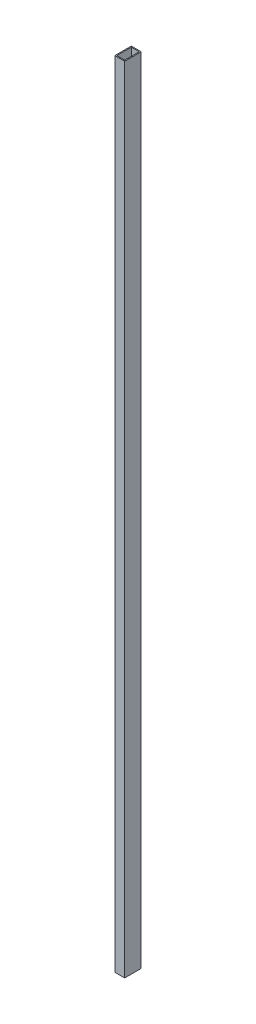
ISO-10303-21;
HEADER;
FILE_DESCRIPTION(('STEP AP214'),'2;1');
FILE_NAME('part.step','',(''),(''),'','','');
FILE_SCHEMA(('AUTOMOTIVE_DESIGN { 1 0 10303 214 1 1 1 1 }'));
ENDSEC;
DATA;
#1=APPLICATION_CONTEXT('core data for automotive mechanical design processes');
#2=APPLICATION_PROTOCOL_DEFINITION('international standard','automotive_design',2000,#1);
#3=PRODUCT_CONTEXT('',#1,'mechanical');
#4=PRODUCT('Part','Part','',(#3));
#5=PRODUCT_RELATED_PRODUCT_CATEGORY('part','',(#4));
#6=PRODUCT_DEFINITION_FORMATION('','',#4);
#7=PRODUCT_DEFINITION_CONTEXT('part definition',#1,'design');
#8=PRODUCT_DEFINITION('design','',#6,#7);
#9=PRODUCT_DEFINITION_SHAPE('','',#8);
#10=(LENGTH_UNIT() NAMED_UNIT(*) SI_UNIT(.MILLI.,.METRE.));
#11=(NAMED_UNIT(*) PLANE_ANGLE_UNIT() SI_UNIT($,.RADIAN.));
#12=(NAMED_UNIT(*) SI_UNIT($,.STERADIAN.) SOLID_ANGLE_UNIT());
#13=UNCERTAINTY_MEASURE_WITH_UNIT(LENGTH_MEASURE(1.E-05),#10,'distance_accuracy_value','');
#14=(GEOMETRIC_REPRESENTATION_CONTEXT(3) GLOBAL_UNCERTAINTY_ASSIGNED_CONTEXT((#13)) GLOBAL_UNIT_ASSIGNED_CONTEXT((#10,
#11,#12)) REPRESENTATION_CONTEXT('',''));
#15=CARTESIAN_POINT('',(0.,0.,0.));
#16=DIRECTION('',(0.,0.,1.));
#17=DIRECTION('',(1.,0.,0.));
#18=AXIS2_PLACEMENT_3D('',#15,#16,#17);
#19=CARTESIAN_POINT('',(0.,6096.,-127.));
#20=DIRECTION('',(0.,-1.,0.));
#21=DIRECTION('',(0.,0.,-1.));
#22=AXIS2_PLACEMENT_3D('',#19,#20,#21);
#23=PLANE('',#22);
#24=DIRECTION('',(0.,0.,1.));
#25=VECTOR('',#24,1.);
#26=CARTESIAN_POINT('',(0.,6096.,0.));
#27=LINE('',#26,#25);
#28=CARTESIAN_POINT('',(0.,6096.,-127.));
#29=VERTEX_POINT('',#28);
#30=CARTESIAN_POINT('',(0.,6096.,0.));
#31=VERTEX_POINT('',#30);
#32=EDGE_CURVE('E134',#29,#31,#27,.T.);
#33=ORIENTED_EDGE('',*,*,#32,.T.);
#34=DIRECTION('',(1.,0.,0.));
#35=VECTOR('',#34,1.);
#36=CARTESIAN_POINT('',(0.,6096.,0.));
#37=LINE('',#36,#35);
#38=CARTESIAN_POINT('',(76.2,6096.,0.));
#39=VERTEX_POINT('',#38);
#40=EDGE_CURVE('E137',#31,#39,#37,.T.);
#41=ORIENTED_EDGE('',*,*,#40,.T.);
#42=DIRECTION('',(0.,0.,-1.));
#43=VECTOR('',#42,1.);
#44=CARTESIAN_POINT('',(76.2,6096.,0.));
#45=LINE('',#44,#43);
#46=CARTESIAN_POINT('',(76.2,6096.,-127.));
#47=VERTEX_POINT('',#46);
#48=EDGE_CURVE('E140',#39,#47,#45,.T.);
#49=ORIENTED_EDGE('',*,*,#48,.T.);
#50=DIRECTION('',(-1.,0.,0.));
#51=VECTOR('',#50,1.);
#52=CARTESIAN_POINT('',(0.,6096.,-127.));
#53=LINE('',#52,#51);
#54=EDGE_CURVE('E142',#47,#29,#53,.T.);
#55=ORIENTED_EDGE('',*,*,#54,.T.);
#56=EDGE_LOOP('',(#33,#41,#49,#55));
#57=FACE_BOUND('',#56,.T.);
#58=DIRECTION('',(0.,0.,1.));
#59=VECTOR('',#58,1.);
#60=CARTESIAN_POINT('',(7.62,6096.,-7.62));
#61=LINE('',#60,#59);
#62=CARTESIAN_POINT('',(7.62,6096.,-119.38));
#63=VERTEX_POINT('',#62);
#64=CARTESIAN_POINT('',(7.62,6096.,-7.62));
#65=VERTEX_POINT('',#64);
#66=EDGE_CURVE('E98',#63,#65,#61,.T.);
#67=ORIENTED_EDGE('',*,*,#66,.F.);
#68=DIRECTION('',(-1.,0.,0.));
#69=VECTOR('',#68,1.);
#70=CARTESIAN_POINT('',(7.62,6096.,-119.38));
#71=LINE('',#70,#69);
#72=CARTESIAN_POINT('',(68.58,6096.,-119.38));
#73=VERTEX_POINT('',#72);
#74=EDGE_CURVE('E120',#73,#63,#71,.T.);
#75=ORIENTED_EDGE('',*,*,#74,.F.);
#76=DIRECTION('',(0.,0.,-1.));
#77=VECTOR('',#76,1.);
#78=CARTESIAN_POINT('',(68.58,6096.,-7.62));
#79=LINE('',#78,#77);
#80=CARTESIAN_POINT('',(68.58,6096.,-7.62));
#81=VERTEX_POINT('',#80);
#82=EDGE_CURVE('E118',#81,#73,#79,.T.);
#83=ORIENTED_EDGE('',*,*,#82,.F.);
#84=DIRECTION('',(1.,0.,0.));
#85=VECTOR('',#84,1.);
#86=CARTESIAN_POINT('',(7.62,6096.,-7.62));
#87=LINE('',#86,#85);
#88=EDGE_CURVE('E106',#65,#81,#87,.T.);
#89=ORIENTED_EDGE('',*,*,#88,.F.);
#90=EDGE_LOOP('',(#67,#75,#83,#89));
#91=FACE_BOUND('',#90,.T.);
#92=ADVANCED_FACE('F33',(#57,#91),#23,.F.);
#93=CARTESIAN_POINT('',(0.,0.,-127.));
#94=DIRECTION('',(0.,-1.,0.));
#95=DIRECTION('',(0.,0.,-1.));
#96=AXIS2_PLACEMENT_3D('',#93,#94,#95);
#97=PLANE('',#96);
#98=DIRECTION('',(0.,0.,1.));
#99=VECTOR('',#98,1.);
#100=CARTESIAN_POINT('',(0.,0.,0.));
#101=LINE('',#100,#99);
#102=CARTESIAN_POINT('',(0.,0.,-127.));
#103=VERTEX_POINT('',#102);
#104=CARTESIAN_POINT('',(0.,0.,0.));
#105=VERTEX_POINT('',#104);
#106=EDGE_CURVE('E114',#103,#105,#101,.T.);
#107=ORIENTED_EDGE('',*,*,#106,.F.);
#108=DIRECTION('',(-1.,0.,0.));
#109=VECTOR('',#108,1.);
#110=CARTESIAN_POINT('',(0.,0.,-127.));
#111=LINE('',#110,#109);
#112=CARTESIAN_POINT('',(76.2,0.,-127.));
#113=VERTEX_POINT('',#112);
#114=EDGE_CURVE('E138',#113,#103,#111,.T.);
#115=ORIENTED_EDGE('',*,*,#114,.F.);
#116=DIRECTION('',(0.,0.,-1.));
#117=VECTOR('',#116,1.);
#118=CARTESIAN_POINT('',(76.2,0.,0.));
#119=LINE('',#118,#117);
#120=CARTESIAN_POINT('',(76.2,0.,0.));
#121=VERTEX_POINT('',#120);
#122=EDGE_CURVE('E149',#121,#113,#119,.T.);
#123=ORIENTED_EDGE('',*,*,#122,.F.);
#124=DIRECTION('',(1.,0.,0.));
#125=VECTOR('',#124,1.);
#126=CARTESIAN_POINT('',(0.,0.,0.));
#127=LINE('',#126,#125);
#128=EDGE_CURVE('E147',#105,#121,#127,.T.);
#129=ORIENTED_EDGE('',*,*,#128,.F.);
#130=EDGE_LOOP('',(#107,#115,#123,#129));
#131=FACE_BOUND('',#130,.T.);
#132=DIRECTION('',(-1.,0.,0.));
#133=VECTOR('',#132,1.);
#134=CARTESIAN_POINT('',(7.62,0.,-119.38));
#135=LINE('',#134,#133);
#136=CARTESIAN_POINT('',(68.58,0.,-119.38));
#137=VERTEX_POINT('',#136);
#138=CARTESIAN_POINT('',(7.62,0.,-119.38));
#139=VERTEX_POINT('',#138);
#140=EDGE_CURVE('E107',#137,#139,#135,.T.);
#141=ORIENTED_EDGE('',*,*,#140,.T.);
#142=DIRECTION('',(0.,0.,1.));
#143=VECTOR('',#142,1.);
#144=CARTESIAN_POINT('',(7.62,0.,-7.62));
#145=LINE('',#144,#143);
#146=CARTESIAN_POINT('',(7.62,0.,-7.62));
#147=VERTEX_POINT('',#146);
#148=EDGE_CURVE('E56',#139,#147,#145,.T.);
#149=ORIENTED_EDGE('',*,*,#148,.T.);
#150=DIRECTION('',(1.,0.,0.));
#151=VECTOR('',#150,1.);
#152=CARTESIAN_POINT('',(7.62,0.,-7.62));
#153=LINE('',#152,#151);
#154=CARTESIAN_POINT('',(68.58,0.,-7.62));
#155=VERTEX_POINT('',#154);
#156=EDGE_CURVE('E113',#147,#155,#153,.T.);
#157=ORIENTED_EDGE('',*,*,#156,.T.);
#158=DIRECTION('',(0.,0.,-1.));
#159=VECTOR('',#158,1.);
#160=CARTESIAN_POINT('',(68.58,0.,-7.62));
#161=LINE('',#160,#159);
#162=EDGE_CURVE('E126',#155,#137,#161,.T.);
#163=ORIENTED_EDGE('',*,*,#162,.T.);
#164=EDGE_LOOP('',(#141,#149,#157,#163));
#165=FACE_BOUND('',#164,.T.);
#166=ADVANCED_FACE('F167',(#131,#165),#97,.T.);
#167=CARTESIAN_POINT('',(0.,6096.,0.));
#168=DIRECTION('',(1.,0.,0.));
#169=DIRECTION('',(0.,0.,-1.));
#170=AXIS2_PLACEMENT_3D('',#167,#168,#169);
#171=PLANE('',#170);
#172=ORIENTED_EDGE('',*,*,#106,.T.);
#173=DIRECTION('',(0.,-1.,0.));
#174=VECTOR('',#173,1.);
#175=CARTESIAN_POINT('',(0.,6096.,0.));
#176=LINE('',#175,#174);
#177=EDGE_CURVE('E11',#31,#105,#176,.T.);
#178=ORIENTED_EDGE('',*,*,#177,.F.);
#179=ORIENTED_EDGE('',*,*,#32,.F.);
#180=DIRECTION('',(0.,-1.,0.));
#181=VECTOR('',#180,1.);
#182=CARTESIAN_POINT('',(0.,6096.,-127.));
#183=LINE('',#182,#181);
#184=EDGE_CURVE('E144',#29,#103,#183,.T.);
#185=ORIENTED_EDGE('',*,*,#184,.T.);
#186=EDGE_LOOP('',(#172,#178,#179,#185));
#187=FACE_BOUND('',#186,.T.);
#188=ADVANCED_FACE('F35',(#187),#171,.F.);
#189=CARTESIAN_POINT('',(0.,6096.,0.));
#190=DIRECTION('',(0.,0.,-1.));
#191=DIRECTION('',(-1.,0.,0.));
#192=AXIS2_PLACEMENT_3D('',#189,#190,#191);
#193=PLANE('',#192);
#194=ORIENTED_EDGE('',*,*,#128,.T.);
#195=DIRECTION('',(0.,-1.,0.));
#196=VECTOR('',#195,1.);
#197=CARTESIAN_POINT('',(76.2,6096.,0.));
#198=LINE('',#197,#196);
#199=EDGE_CURVE('E41',#39,#121,#198,.T.);
#200=ORIENTED_EDGE('',*,*,#199,.F.);
#201=ORIENTED_EDGE('',*,*,#40,.F.);
#202=ORIENTED_EDGE('',*,*,#177,.T.);
#203=EDGE_LOOP('',(#194,#200,#201,#202));
#204=FACE_BOUND('',#203,.T.);
#205=ADVANCED_FACE('F177',(#204),#193,.F.);
#206=CARTESIAN_POINT('',(76.2,6096.,0.));
#207=DIRECTION('',(-1.,0.,0.));
#208=DIRECTION('',(0.,0.,1.));
#209=AXIS2_PLACEMENT_3D('',#206,#207,#208);
#210=PLANE('',#209);
#211=ORIENTED_EDGE('',*,*,#122,.T.);
#212=DIRECTION('',(0.,-1.,0.));
#213=VECTOR('',#212,1.);
#214=CARTESIAN_POINT('',(76.2,6096.,-127.));
#215=LINE('',#214,#213);
#216=EDGE_CURVE('E154',#47,#113,#215,.T.);
#217=ORIENTED_EDGE('',*,*,#216,.F.);
#218=ORIENTED_EDGE('',*,*,#48,.F.);
#219=ORIENTED_EDGE('',*,*,#199,.T.);
#220=EDGE_LOOP('',(#211,#217,#218,#219));
#221=FACE_BOUND('',#220,.T.);
#222=ADVANCED_FACE('F161',(#221),#210,.F.);
#223=CARTESIAN_POINT('',(0.,6096.,-127.));
#224=DIRECTION('',(0.,0.,1.));
#225=DIRECTION('',(1.,0.,0.));
#226=AXIS2_PLACEMENT_3D('',#223,#224,#225);
#227=PLANE('',#226);
#228=ORIENTED_EDGE('',*,*,#114,.T.);
#229=ORIENTED_EDGE('',*,*,#184,.F.);
#230=ORIENTED_EDGE('',*,*,#54,.F.);
#231=ORIENTED_EDGE('',*,*,#216,.T.);
#232=EDGE_LOOP('',(#228,#229,#230,#231));
#233=FACE_BOUND('',#232,.T.);
#234=ADVANCED_FACE('F171',(#233),#227,.F.);
#235=CARTESIAN_POINT('',(7.62,6096.,-7.62));
#236=DIRECTION('',(1.,0.,0.));
#237=DIRECTION('',(0.,0.,-1.));
#238=AXIS2_PLACEMENT_3D('',#235,#236,#237);
#239=PLANE('',#238);
#240=ORIENTED_EDGE('',*,*,#148,.F.);
#241=DIRECTION('',(0.,-1.,0.));
#242=VECTOR('',#241,1.);
#243=CARTESIAN_POINT('',(7.62,6096.,-119.38));
#244=LINE('',#243,#242);
#245=EDGE_CURVE('E102',#63,#139,#244,.T.);
#246=ORIENTED_EDGE('',*,*,#245,.F.);
#247=ORIENTED_EDGE('',*,*,#66,.T.);
#248=DIRECTION('',(0.,-1.,0.));
#249=VECTOR('',#248,1.);
#250=CARTESIAN_POINT('',(7.62,6096.,-7.62));
#251=LINE('',#250,#249);
#252=EDGE_CURVE('E101',#65,#147,#251,.T.);
#253=ORIENTED_EDGE('',*,*,#252,.T.);
#254=EDGE_LOOP('',(#240,#246,#247,#253));
#255=FACE_BOUND('',#254,.T.);
#256=ADVANCED_FACE('F100',(#255),#239,.T.);
#257=CARTESIAN_POINT('',(7.62,6096.,-7.62));
#258=DIRECTION('',(0.,0.,-1.));
#259=DIRECTION('',(-1.,0.,0.));
#260=AXIS2_PLACEMENT_3D('',#257,#258,#259);
#261=PLANE('',#260);
#262=ORIENTED_EDGE('',*,*,#156,.F.);
#263=ORIENTED_EDGE('',*,*,#252,.F.);
#264=ORIENTED_EDGE('',*,*,#88,.T.);
#265=DIRECTION('',(0.,-1.,0.));
#266=VECTOR('',#265,1.);
#267=CARTESIAN_POINT('',(68.58,6096.,-7.62));
#268=LINE('',#267,#266);
#269=EDGE_CURVE('E115',#81,#155,#268,.T.);
#270=ORIENTED_EDGE('',*,*,#269,.T.);
#271=EDGE_LOOP('',(#262,#263,#264,#270));
#272=FACE_BOUND('',#271,.T.);
#273=ADVANCED_FACE('F110',(#272),#261,.T.);
#274=CARTESIAN_POINT('',(68.58,6096.,-7.62));
#275=DIRECTION('',(-1.,0.,0.));
#276=DIRECTION('',(0.,0.,1.));
#277=AXIS2_PLACEMENT_3D('',#274,#275,#276);
#278=PLANE('',#277);
#279=ORIENTED_EDGE('',*,*,#162,.F.);
#280=ORIENTED_EDGE('',*,*,#269,.F.);
#281=ORIENTED_EDGE('',*,*,#82,.T.);
#282=DIRECTION('',(0.,-1.,0.));
#283=VECTOR('',#282,1.);
#284=CARTESIAN_POINT('',(68.58,6096.,-119.38));
#285=LINE('',#284,#283);
#286=EDGE_CURVE('E48',#73,#137,#285,.T.);
#287=ORIENTED_EDGE('',*,*,#286,.T.);
#288=EDGE_LOOP('',(#279,#280,#281,#287));
#289=FACE_BOUND('',#288,.T.);
#290=ADVANCED_FACE('F200',(#289),#278,.T.);
#291=CARTESIAN_POINT('',(7.62,6096.,-119.38));
#292=DIRECTION('',(0.,0.,1.));
#293=DIRECTION('',(1.,0.,0.));
#294=AXIS2_PLACEMENT_3D('',#291,#292,#293);
#295=PLANE('',#294);
#296=ORIENTED_EDGE('',*,*,#140,.F.);
#297=ORIENTED_EDGE('',*,*,#286,.F.);
#298=ORIENTED_EDGE('',*,*,#74,.T.);
#299=ORIENTED_EDGE('',*,*,#245,.T.);
#300=EDGE_LOOP('',(#296,#297,#298,#299));
#301=FACE_BOUND('',#300,.T.);
#302=ADVANCED_FACE('F204',(#301),#295,.T.);
#303=CLOSED_SHELL('',(#92,#166,#188,#205,#222,#234,#256,#273,#290,#302));
#304=MANIFOLD_SOLID_BREP('B2',#303);
#305=ADVANCED_BREP_SHAPE_REPRESENTATION('',(#18,#304),#14);
#306=SHAPE_DEFINITION_REPRESENTATION(#9,#305);
ENDSEC;
END-ISO-10303-21;
